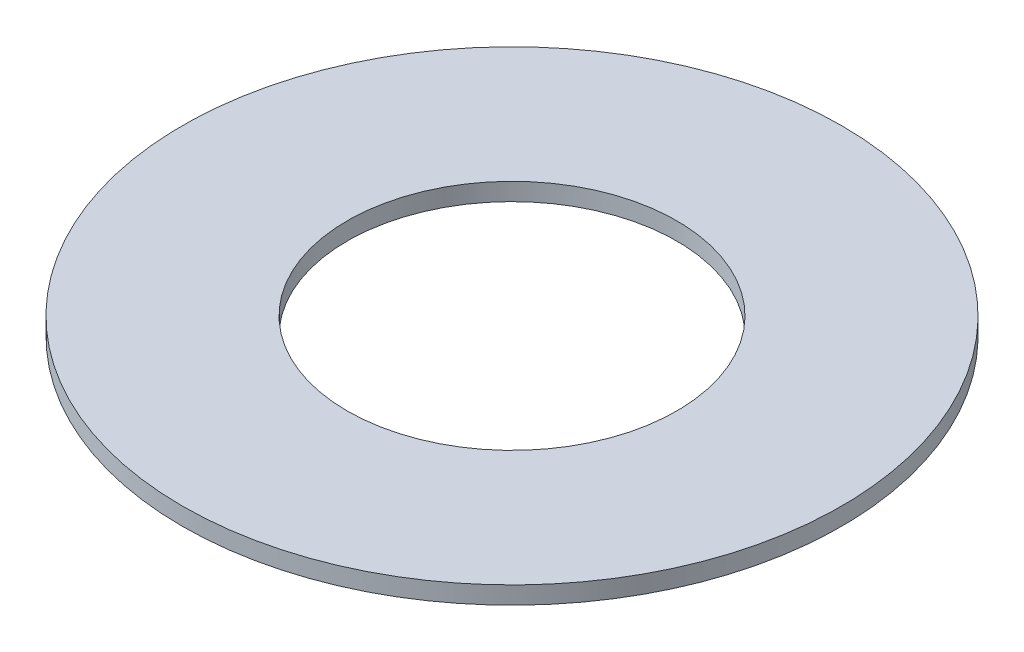
ISO-10303-21;
HEADER;
FILE_DESCRIPTION(('STEP AP214'),'2;1');
FILE_NAME('part.step','',(''),(''),'','','');
FILE_SCHEMA(('AUTOMOTIVE_DESIGN { 1 0 10303 214 1 1 1 1 }'));
ENDSEC;
DATA;
#1=APPLICATION_CONTEXT('core data for automotive mechanical design processes');
#2=APPLICATION_PROTOCOL_DEFINITION('international standard','automotive_design',2000,#1);
#3=PRODUCT_CONTEXT('',#1,'mechanical');
#4=PRODUCT('Part','Part','',(#3));
#5=PRODUCT_RELATED_PRODUCT_CATEGORY('part','',(#4));
#6=PRODUCT_DEFINITION_FORMATION('','',#4);
#7=PRODUCT_DEFINITION_CONTEXT('part definition',#1,'design');
#8=PRODUCT_DEFINITION('design','',#6,#7);
#9=PRODUCT_DEFINITION_SHAPE('','',#8);
#10=(LENGTH_UNIT() NAMED_UNIT(*) SI_UNIT(.MILLI.,.METRE.));
#11=(NAMED_UNIT(*) PLANE_ANGLE_UNIT() SI_UNIT($,.RADIAN.));
#12=(NAMED_UNIT(*) SI_UNIT($,.STERADIAN.) SOLID_ANGLE_UNIT());
#13=UNCERTAINTY_MEASURE_WITH_UNIT(LENGTH_MEASURE(1.E-05),#10,'distance_accuracy_value','');
#14=(GEOMETRIC_REPRESENTATION_CONTEXT(3) GLOBAL_UNCERTAINTY_ASSIGNED_CONTEXT((#13)) GLOBAL_UNIT_ASSIGNED_CONTEXT((#10,
#11,#12)) REPRESENTATION_CONTEXT('',''));
#15=CARTESIAN_POINT('',(0.,0.,0.));
#16=DIRECTION('',(0.,0.,1.));
#17=DIRECTION('',(1.,0.,0.));
#18=AXIS2_PLACEMENT_3D('',#15,#16,#17);
#19=CARTESIAN_POINT('',(0.,4.,0.));
#20=DIRECTION('',(0.,-1.,0.));
#21=DIRECTION('',(0.,0.,-1.));
#22=AXIS2_PLACEMENT_3D('',#19,#20,#21);
#23=CYLINDRICAL_SURFACE('',#22,75.);
#24=CARTESIAN_POINT('',(0.,4.,0.));
#25=DIRECTION('',(0.,1.,0.));
#26=DIRECTION('',(0.,0.,1.));
#27=AXIS2_PLACEMENT_3D('',#24,#25,#26);
#28=CIRCLE('',#27,75.);
#29=CARTESIAN_POINT('',(0.,4.,75.));
#30=VERTEX_POINT('',#29);
#31=EDGE_CURVE('E10',#30,#30,#28,.T.);
#32=ORIENTED_EDGE('',*,*,#31,.F.);
#33=EDGE_LOOP('',(#32));
#34=FACE_BOUND('',#33,.T.);
#35=CARTESIAN_POINT('',(0.,0.,0.));
#36=DIRECTION('',(0.,1.,0.));
#37=DIRECTION('',(0.,0.,1.));
#38=AXIS2_PLACEMENT_3D('',#35,#36,#37);
#39=CIRCLE('',#38,75.);
#40=CARTESIAN_POINT('',(0.,0.,75.));
#41=VERTEX_POINT('',#40);
#42=EDGE_CURVE('E37',#41,#41,#39,.T.);
#43=ORIENTED_EDGE('',*,*,#42,.T.);
#44=EDGE_LOOP('',(#43));
#45=FACE_BOUND('',#44,.T.);
#46=ADVANCED_FACE('F40',(#34,#45),#23,.T.);
#47=CARTESIAN_POINT('',(0.,4.,0.));
#48=DIRECTION('',(0.,1.,0.));
#49=DIRECTION('',(0.,0.,1.));
#50=AXIS2_PLACEMENT_3D('',#47,#48,#49);
#51=PLANE('',#50);
#52=CARTESIAN_POINT('',(0.,4.,0.));
#53=DIRECTION('',(0.,1.,0.));
#54=DIRECTION('',(0.,0.,1.));
#55=AXIS2_PLACEMENT_3D('',#52,#53,#54);
#56=CIRCLE('',#55,37.5);
#57=CARTESIAN_POINT('',(0.,4.,37.5));
#58=VERTEX_POINT('',#57);
#59=EDGE_CURVE('E50',#58,#58,#56,.T.);
#60=ORIENTED_EDGE('',*,*,#59,.F.);
#61=EDGE_LOOP('',(#60));
#62=FACE_BOUND('',#61,.T.);
#63=ORIENTED_EDGE('',*,*,#31,.T.);
#64=EDGE_LOOP('',(#63));
#65=FACE_BOUND('',#64,.T.);
#66=ADVANCED_FACE('F59',(#62,#65),#51,.T.);
#67=CARTESIAN_POINT('',(0.,0.,0.));
#68=DIRECTION('',(0.,1.,0.));
#69=DIRECTION('',(0.,0.,1.));
#70=AXIS2_PLACEMENT_3D('',#67,#68,#69);
#71=PLANE('',#70);
#72=CARTESIAN_POINT('',(0.,0.,0.));
#73=DIRECTION('',(0.,1.,0.));
#74=DIRECTION('',(0.,0.,1.));
#75=AXIS2_PLACEMENT_3D('',#72,#73,#74);
#76=CIRCLE('',#75,37.5);
#77=CARTESIAN_POINT('',(0.,0.,37.5));
#78=VERTEX_POINT('',#77);
#79=EDGE_CURVE('E47',#78,#78,#76,.T.);
#80=ORIENTED_EDGE('',*,*,#79,.T.);
#81=EDGE_LOOP('',(#80));
#82=FACE_BOUND('',#81,.T.);
#83=ORIENTED_EDGE('',*,*,#42,.F.);
#84=EDGE_LOOP('',(#83));
#85=FACE_BOUND('',#84,.T.);
#86=ADVANCED_FACE('F58',(#82,#85),#71,.F.);
#87=CARTESIAN_POINT('',(0.,4.,0.));
#88=DIRECTION('',(0.,-1.,0.));
#89=DIRECTION('',(0.,0.,-1.));
#90=AXIS2_PLACEMENT_3D('',#87,#88,#89);
#91=CYLINDRICAL_SURFACE('',#90,37.5);
#92=ORIENTED_EDGE('',*,*,#59,.T.);
#93=EDGE_LOOP('',(#92));
#94=FACE_BOUND('',#93,.T.);
#95=ORIENTED_EDGE('',*,*,#79,.F.);
#96=EDGE_LOOP('',(#95));
#97=FACE_BOUND('',#96,.T.);
#98=ADVANCED_FACE('F54',(#94,#97),#91,.F.);
#99=CLOSED_SHELL('',(#46,#66,#86,#98));
#100=MANIFOLD_SOLID_BREP('B2',#99);
#101=ADVANCED_BREP_SHAPE_REPRESENTATION('',(#18,#100),#14);
#102=SHAPE_DEFINITION_REPRESENTATION(#9,#101);
ENDSEC;
END-ISO-10303-21;
